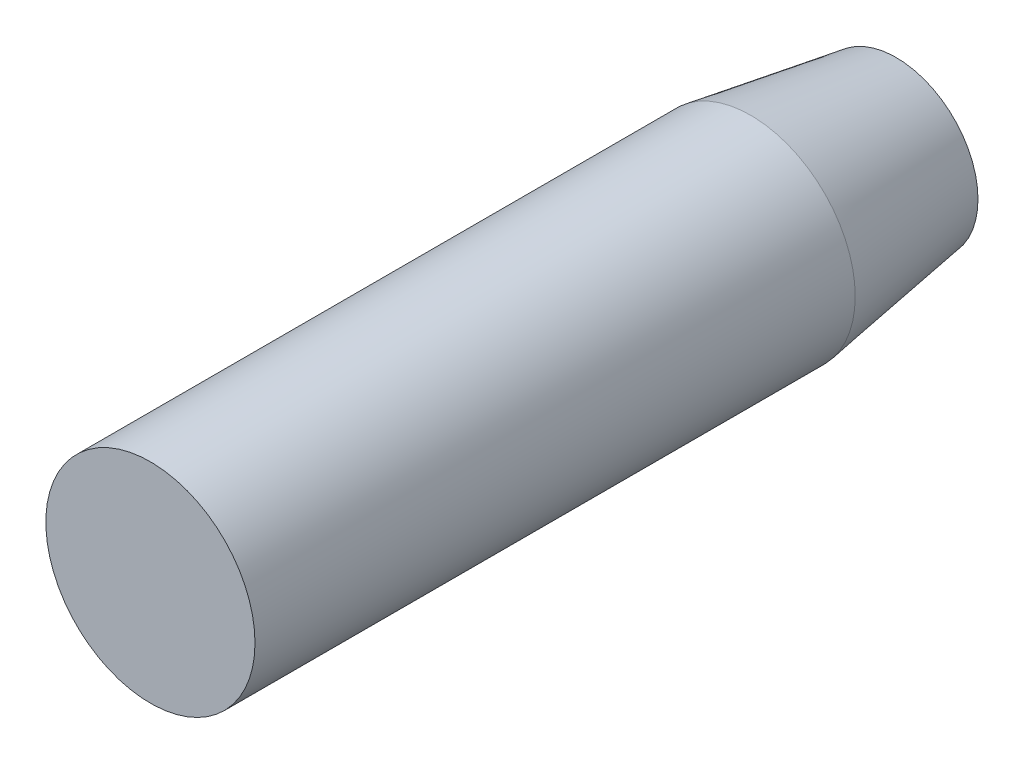
ISO-10303-21;
HEADER;
FILE_DESCRIPTION(('STEP AP214'),'2;1');
FILE_NAME('part.step','',(''),(''),'','','');
FILE_SCHEMA(('AUTOMOTIVE_DESIGN { 1 0 10303 214 1 1 1 1 }'));
ENDSEC;
DATA;
#1=APPLICATION_CONTEXT('core data for automotive mechanical design processes');
#2=APPLICATION_PROTOCOL_DEFINITION('international standard','automotive_design',2000,#1);
#3=PRODUCT_CONTEXT('',#1,'mechanical');
#4=PRODUCT('Part','Part','',(#3));
#5=PRODUCT_RELATED_PRODUCT_CATEGORY('part','',(#4));
#6=PRODUCT_DEFINITION_FORMATION('','',#4);
#7=PRODUCT_DEFINITION_CONTEXT('part definition',#1,'design');
#8=PRODUCT_DEFINITION('design','',#6,#7);
#9=PRODUCT_DEFINITION_SHAPE('','',#8);
#10=(LENGTH_UNIT() NAMED_UNIT(*) SI_UNIT(.MILLI.,.METRE.));
#11=(NAMED_UNIT(*) PLANE_ANGLE_UNIT() SI_UNIT($,.RADIAN.));
#12=(NAMED_UNIT(*) SI_UNIT($,.STERADIAN.) SOLID_ANGLE_UNIT());
#13=UNCERTAINTY_MEASURE_WITH_UNIT(LENGTH_MEASURE(1.E-05),#10,'distance_accuracy_value','');
#14=(GEOMETRIC_REPRESENTATION_CONTEXT(3) GLOBAL_UNCERTAINTY_ASSIGNED_CONTEXT((#13)) GLOBAL_UNIT_ASSIGNED_CONTEXT((#10,
#11,#12)) REPRESENTATION_CONTEXT('',''));
#15=CARTESIAN_POINT('',(0.,0.,0.));
#16=DIRECTION('',(0.,0.,1.));
#17=DIRECTION('',(1.,0.,0.));
#18=AXIS2_PLACEMENT_3D('',#15,#16,#17);
#19=CARTESIAN_POINT('',(0.,0.,-65.0875));
#20=DIRECTION('',(0.,0.,1.));
#21=DIRECTION('',(-1.,0.,0.));
#22=AXIS2_PLACEMENT_3D('',#19,#20,#21);
#23=CYLINDRICAL_SURFACE('',#22,18.25625);
#24=CARTESIAN_POINT('',(0.,0.,-39.6874999999998));
#25=DIRECTION('',(0.,0.,1.));
#26=DIRECTION('',(1.,0.,0.));
#27=AXIS2_PLACEMENT_3D('',#24,#25,#26);
#28=CIRCLE('',#27,18.25625);
#29=CARTESIAN_POINT('',(18.25625,0.,-39.6874999999998));
#30=VERTEX_POINT('',#29);
#31=EDGE_CURVE('E10',#30,#30,#28,.F.);
#32=ORIENTED_EDGE('',*,*,#31,.F.);
#33=EDGE_LOOP('',(#32));
#34=FACE_BOUND('',#33,.T.);
#35=CARTESIAN_POINT('',(0.,0.,65.0875));
#36=DIRECTION('',(0.,0.,1.));
#37=DIRECTION('',(1.,0.,0.));
#38=AXIS2_PLACEMENT_3D('',#35,#36,#37);
#39=CIRCLE('',#38,18.25625);
#40=CARTESIAN_POINT('',(18.25625,0.,65.0875));
#41=VERTEX_POINT('',#40);
#42=EDGE_CURVE('E44',#41,#41,#39,.T.);
#43=ORIENTED_EDGE('',*,*,#42,.F.);
#44=EDGE_LOOP('',(#43));
#45=FACE_BOUND('',#44,.T.);
#46=ADVANCED_FACE('F33',(#34,#45),#23,.T.);
#47=CARTESIAN_POINT('',(0.,0.,-65.0875));
#48=DIRECTION('',(0.,0.,-1.));
#49=DIRECTION('',(1.,0.,0.));
#50=AXIS2_PLACEMENT_3D('',#47,#48,#49);
#51=PLANE('',#50);
#52=CARTESIAN_POINT('',(0.,0.,-65.0875));
#53=DIRECTION('',(0.,0.,1.));
#54=DIRECTION('',(1.,0.,0.));
#55=AXIS2_PLACEMENT_3D('',#52,#53,#54);
#56=CIRCLE('',#55,14.2875000000001);
#57=CARTESIAN_POINT('',(14.2875000000001,0.,-65.0875));
#58=VERTEX_POINT('',#57);
#59=EDGE_CURVE('E40',#58,#58,#56,.T.);
#60=ORIENTED_EDGE('',*,*,#59,.F.);
#61=EDGE_LOOP('',(#60));
#62=FACE_BOUND('',#61,.T.);
#63=ADVANCED_FACE('F54',(#62),#51,.T.);
#64=CARTESIAN_POINT('',(0.,0.,65.0875));
#65=DIRECTION('',(0.,0.,-1.));
#66=DIRECTION('',(1.,0.,0.));
#67=AXIS2_PLACEMENT_3D('',#64,#65,#66);
#68=PLANE('',#67);
#69=ORIENTED_EDGE('',*,*,#42,.T.);
#70=EDGE_LOOP('',(#69));
#71=FACE_BOUND('',#70,.T.);
#72=ADVANCED_FACE('F51',(#71),#68,.F.);
#73=CARTESIAN_POINT('',(0.,0.,-65.0875));
#74=DIRECTION('',(0.,0.,1.));
#75=DIRECTION('',(-1.,0.,0.));
#76=AXIS2_PLACEMENT_3D('',#73,#74,#75);
#77=CONICAL_SURFACE('',#76,14.2875000000001,0.154996741923938);
#78=ORIENTED_EDGE('',*,*,#31,.T.);
#79=EDGE_LOOP('',(#78));
#80=FACE_BOUND('',#79,.T.);
#81=ORIENTED_EDGE('',*,*,#59,.T.);
#82=EDGE_LOOP('',(#81));
#83=FACE_BOUND('',#82,.T.);
#84=ADVANCED_FACE('F35',(#80,#83),#77,.T.);
#85=CLOSED_SHELL('',(#46,#63,#72,#84));
#86=MANIFOLD_SOLID_BREP('B2',#85);
#87=ADVANCED_BREP_SHAPE_REPRESENTATION('',(#18,#86),#14);
#88=SHAPE_DEFINITION_REPRESENTATION(#9,#87);
ENDSEC;
END-ISO-10303-21;
